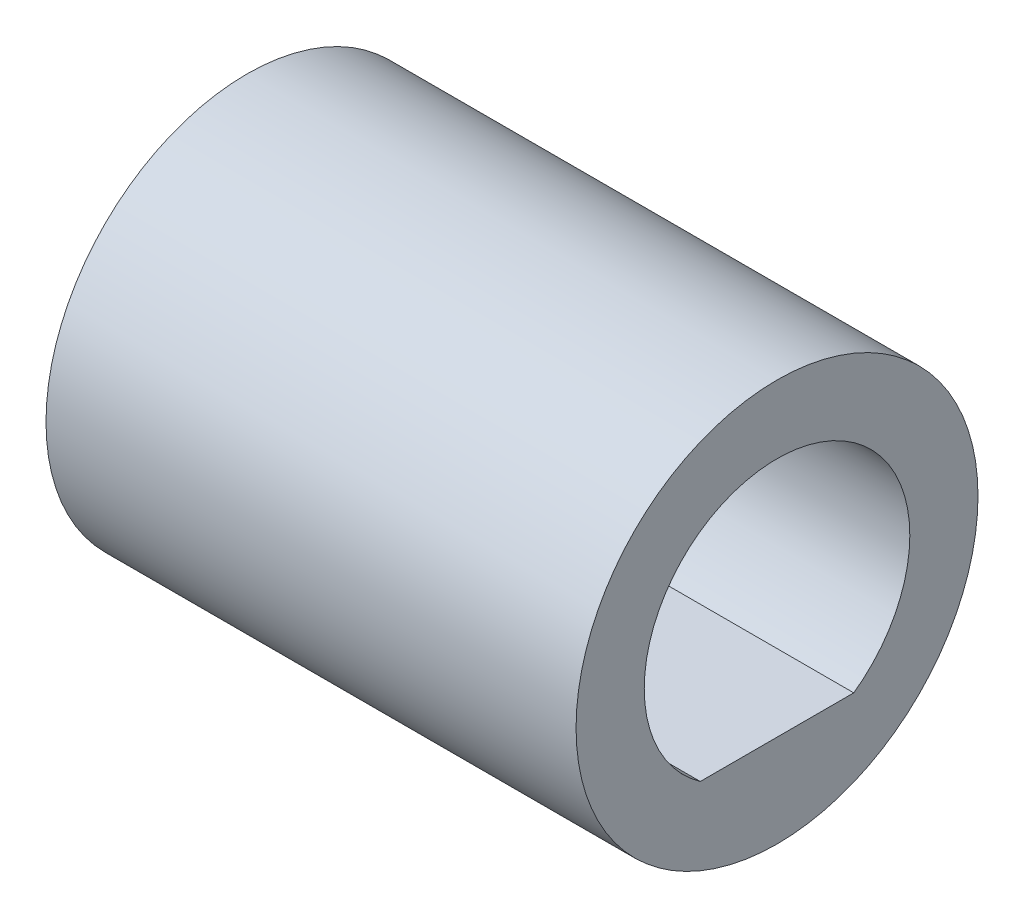
ISO-10303-21;
HEADER;
FILE_DESCRIPTION(('STEP AP214'),'2;1');
FILE_NAME('part.step','',(''),(''),'','','');
FILE_SCHEMA(('AUTOMOTIVE_DESIGN { 1 0 10303 214 1 1 1 1 }'));
ENDSEC;
DATA;
#1=APPLICATION_CONTEXT('core data for automotive mechanical design processes');
#2=APPLICATION_PROTOCOL_DEFINITION('international standard','automotive_design',2000,#1);
#3=PRODUCT_CONTEXT('',#1,'mechanical');
#4=PRODUCT('Part','Part','',(#3));
#5=PRODUCT_RELATED_PRODUCT_CATEGORY('part','',(#4));
#6=PRODUCT_DEFINITION_FORMATION('','',#4);
#7=PRODUCT_DEFINITION_CONTEXT('part definition',#1,'design');
#8=PRODUCT_DEFINITION('design','',#6,#7);
#9=PRODUCT_DEFINITION_SHAPE('','',#8);
#10=(LENGTH_UNIT() NAMED_UNIT(*) SI_UNIT(.MILLI.,.METRE.));
#11=(NAMED_UNIT(*) PLANE_ANGLE_UNIT() SI_UNIT($,.RADIAN.));
#12=(NAMED_UNIT(*) SI_UNIT($,.STERADIAN.) SOLID_ANGLE_UNIT());
#13=UNCERTAINTY_MEASURE_WITH_UNIT(LENGTH_MEASURE(1.E-05),#10,'distance_accuracy_value','');
#14=(GEOMETRIC_REPRESENTATION_CONTEXT(3) GLOBAL_UNCERTAINTY_ASSIGNED_CONTEXT((#13)) GLOBAL_UNIT_ASSIGNED_CONTEXT((#10,
#11,#12)) REPRESENTATION_CONTEXT('',''));
#15=CARTESIAN_POINT('',(0.,0.,0.));
#16=DIRECTION('',(0.,0.,1.));
#17=DIRECTION('',(1.,0.,0.));
#18=AXIS2_PLACEMENT_3D('',#15,#16,#17);
#19=CARTESIAN_POINT('',(22.1137084989848,0.,0.));
#20=DIRECTION('',(-1.,0.,0.));
#21=DIRECTION('',(0.,0.,1.));
#22=AXIS2_PLACEMENT_3D('',#19,#20,#21);
#23=CYLINDRICAL_SURFACE('',#22,4.);
#24=CARTESIAN_POINT('',(0.,0.,0.));
#25=DIRECTION('',(1.,0.,0.));
#26=DIRECTION('',(0.,0.,-1.));
#27=AXIS2_PLACEMENT_3D('',#24,#25,#26);
#28=CIRCLE('',#27,4.);
#29=CARTESIAN_POINT('',(0.,0.,-4.00000000000001));
#30=VERTEX_POINT('',#29);
#31=EDGE_CURVE('E78',#30,#30,#28,.T.);
#32=ORIENTED_EDGE('',*,*,#31,.T.);
#33=EDGE_LOOP('',(#32));
#34=FACE_BOUND('',#33,.T.);
#35=CARTESIAN_POINT('',(10.55,0.,0.));
#36=DIRECTION('',(1.,0.,0.));
#37=DIRECTION('',(0.,1.,0.));
#38=AXIS2_PLACEMENT_3D('',#35,#36,#37);
#39=CIRCLE('',#38,4.);
#40=CARTESIAN_POINT('',(10.55,4.,0.));
#41=VERTEX_POINT('',#40);
#42=EDGE_CURVE('E12',#41,#41,#39,.T.);
#43=ORIENTED_EDGE('',*,*,#42,.F.);
#44=EDGE_LOOP('',(#43));
#45=FACE_BOUND('',#44,.T.);
#46=ADVANCED_FACE('F46',(#34,#45),#23,.T.);
#47=CARTESIAN_POINT('',(0.,0.,0.));
#48=DIRECTION('',(1.,0.,0.));
#49=DIRECTION('',(0.,0.,-1.));
#50=AXIS2_PLACEMENT_3D('',#47,#48,#49);
#51=PLANE('',#50);
#52=ORIENTED_EDGE('',*,*,#31,.F.);
#53=EDGE_LOOP('',(#52));
#54=FACE_BOUND('',#53,.T.);
#55=CARTESIAN_POINT('',(0.,0.,0.));
#56=DIRECTION('',(1.,0.,0.));
#57=DIRECTION('',(0.,0.,-1.));
#58=AXIS2_PLACEMENT_3D('',#55,#56,#57);
#59=CIRCLE('',#58,2.64300000000001);
#60=CARTESIAN_POINT('',(0.,-2.157,-1.52735064736297));
#61=VERTEX_POINT('',#60);
#62=CARTESIAN_POINT('',(0.,-2.157,1.52735064736296));
#63=VERTEX_POINT('',#62);
#64=EDGE_CURVE('E83',#61,#63,#59,.T.);
#65=ORIENTED_EDGE('',*,*,#64,.T.);
#66=DIRECTION('',(0.,0.,-1.));
#67=VECTOR('',#66,1.);
#68=CARTESIAN_POINT('',(0.,-2.157,1.52735064736296));
#69=LINE('',#68,#67);
#70=EDGE_CURVE('E87',#63,#61,#69,.T.);
#71=ORIENTED_EDGE('',*,*,#70,.T.);
#72=EDGE_LOOP('',(#65,#71));
#73=FACE_BOUND('',#72,.T.);
#74=ADVANCED_FACE('F100',(#54,#73),#51,.F.);
#75=CARTESIAN_POINT('',(22.1137084989848,-2.157,1.52735064736296));
#76=DIRECTION('',(0.,1.,0.));
#77=DIRECTION('',(0.,0.,1.));
#78=AXIS2_PLACEMENT_3D('',#75,#76,#77);
#79=PLANE('',#78);
#80=DIRECTION('',(-1.,0.,0.));
#81=VECTOR('',#80,1.);
#82=CARTESIAN_POINT('',(22.1137084989848,-2.157,1.52735064736296));
#83=LINE('',#82,#81);
#84=CARTESIAN_POINT('',(10.55,-2.157,1.52735064736296));
#85=VERTEX_POINT('',#84);
#86=EDGE_CURVE('E81',#85,#63,#83,.T.);
#87=ORIENTED_EDGE('',*,*,#86,.F.);
#88=DIRECTION('',(0.,0.,-1.));
#89=VECTOR('',#88,1.);
#90=CARTESIAN_POINT('',(10.55,-2.157,1.52735064736296));
#91=LINE('',#90,#89);
#92=CARTESIAN_POINT('',(10.55,-2.157,-1.52735064736297));
#93=VERTEX_POINT('',#92);
#94=EDGE_CURVE('E49',#85,#93,#91,.T.);
#95=ORIENTED_EDGE('',*,*,#94,.T.);
#96=DIRECTION('',(-1.,0.,0.));
#97=VECTOR('',#96,1.);
#98=CARTESIAN_POINT('',(22.1137084989848,-2.157,-1.52735064736297));
#99=LINE('',#98,#97);
#100=EDGE_CURVE('E68',#93,#61,#99,.T.);
#101=ORIENTED_EDGE('',*,*,#100,.T.);
#102=ORIENTED_EDGE('',*,*,#70,.F.);
#103=EDGE_LOOP('',(#87,#95,#101,#102));
#104=FACE_BOUND('',#103,.T.);
#105=ADVANCED_FACE('F85',(#104),#79,.T.);
#106=CARTESIAN_POINT('',(22.1137084989848,0.,0.));
#107=DIRECTION('',(-1.,0.,0.));
#108=DIRECTION('',(0.,0.,1.));
#109=AXIS2_PLACEMENT_3D('',#106,#107,#108);
#110=CYLINDRICAL_SURFACE('',#109,2.64300000000001);
#111=ORIENTED_EDGE('',*,*,#100,.F.);
#112=CARTESIAN_POINT('',(10.55,0.,0.));
#113=DIRECTION('',(1.,0.,0.));
#114=DIRECTION('',(0.,1.,0.));
#115=AXIS2_PLACEMENT_3D('',#112,#113,#114);
#116=CIRCLE('',#115,2.64300000000001);
#117=EDGE_CURVE('E61',#93,#85,#116,.T.);
#118=ORIENTED_EDGE('',*,*,#117,.T.);
#119=ORIENTED_EDGE('',*,*,#86,.T.);
#120=ORIENTED_EDGE('',*,*,#64,.F.);
#121=EDGE_LOOP('',(#111,#118,#119,#120));
#122=FACE_BOUND('',#121,.T.);
#123=ADVANCED_FACE('F80',(#122),#110,.F.);
#124=CARTESIAN_POINT('',(10.55,0.,0.));
#125=DIRECTION('',(1.,0.,0.));
#126=DIRECTION('',(0.,0.292430258224602,-0.956286852400833));
#127=AXIS2_PLACEMENT_3D('',#124,#125,#126);
#128=PLANE('',#127);
#129=ORIENTED_EDGE('',*,*,#117,.F.);
#130=ORIENTED_EDGE('',*,*,#94,.F.);
#131=EDGE_LOOP('',(#129,#130));
#132=FACE_BOUND('',#131,.T.);
#133=ORIENTED_EDGE('',*,*,#42,.T.);
#134=EDGE_LOOP('',(#133));
#135=FACE_BOUND('',#134,.T.);
#136=ADVANCED_FACE('F74',(#132,#135),#128,.T.);
#137=CLOSED_SHELL('',(#46,#74,#105,#123,#136));
#138=MANIFOLD_SOLID_BREP('B2',#137);
#139=ADVANCED_BREP_SHAPE_REPRESENTATION('',(#18,#138),#14);
#140=SHAPE_DEFINITION_REPRESENTATION(#9,#139);
ENDSEC;
END-ISO-10303-21;
